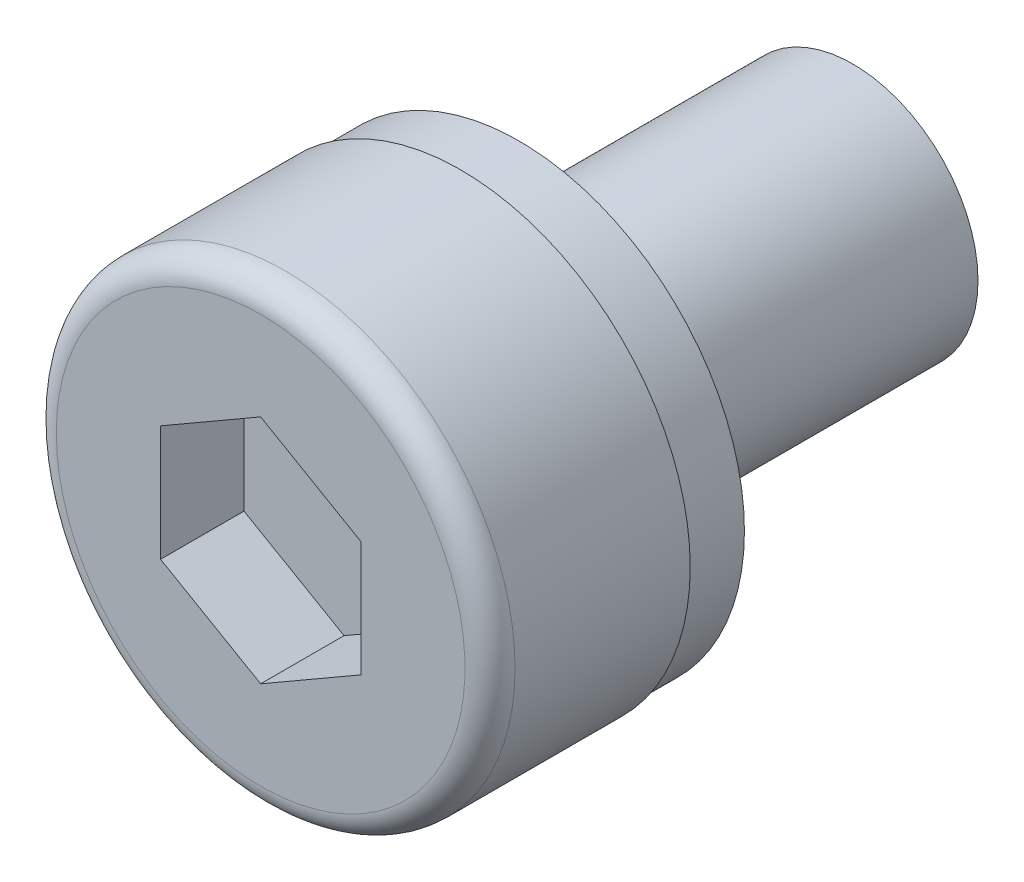
ISO-10303-21;
HEADER;
FILE_DESCRIPTION(('STEP AP214'),'2;1');
FILE_NAME('part.step','',(''),(''),'','','');
FILE_SCHEMA(('AUTOMOTIVE_DESIGN { 1 0 10303 214 1 1 1 1 }'));
ENDSEC;
DATA;
#1=APPLICATION_CONTEXT('core data for automotive mechanical design processes');
#2=APPLICATION_PROTOCOL_DEFINITION('international standard','automotive_design',2000,#1);
#3=PRODUCT_CONTEXT('',#1,'mechanical');
#4=PRODUCT('Part','Part','',(#3));
#5=PRODUCT_RELATED_PRODUCT_CATEGORY('part','',(#4));
#6=PRODUCT_DEFINITION_FORMATION('','',#4);
#7=PRODUCT_DEFINITION_CONTEXT('part definition',#1,'design');
#8=PRODUCT_DEFINITION('design','',#6,#7);
#9=PRODUCT_DEFINITION_SHAPE('','',#8);
#10=(LENGTH_UNIT() NAMED_UNIT(*) SI_UNIT(.MILLI.,.METRE.));
#11=(NAMED_UNIT(*) PLANE_ANGLE_UNIT() SI_UNIT($,.RADIAN.));
#12=(NAMED_UNIT(*) SI_UNIT($,.STERADIAN.) SOLID_ANGLE_UNIT());
#13=UNCERTAINTY_MEASURE_WITH_UNIT(LENGTH_MEASURE(1.E-05),#10,'distance_accuracy_value','');
#14=(GEOMETRIC_REPRESENTATION_CONTEXT(3) GLOBAL_UNCERTAINTY_ASSIGNED_CONTEXT((#13)) GLOBAL_UNIT_ASSIGNED_CONTEXT((#10,
#11,#12)) REPRESENTATION_CONTEXT('',''));
#15=CARTESIAN_POINT('',(0.,0.,0.));
#16=DIRECTION('',(0.,0.,1.));
#17=DIRECTION('',(1.,0.,0.));
#18=AXIS2_PLACEMENT_3D('',#15,#16,#17);
#19=CARTESIAN_POINT('',(0.,0.,0.));
#20=DIRECTION('',(0.,0.,-1.));
#21=DIRECTION('',(1.,0.,0.));
#22=AXIS2_PLACEMENT_3D('',#19,#20,#21);
#23=CYLINDRICAL_SURFACE('',#22,1.5);
#24=CARTESIAN_POINT('',(0.,0.,-4.));
#25=DIRECTION('',(0.,0.,1.));
#26=DIRECTION('',(1.,0.,0.));
#27=AXIS2_PLACEMENT_3D('',#24,#25,#26);
#28=CIRCLE('',#27,1.5);
#29=CARTESIAN_POINT('',(-1.5,0.,-4.));
#30=VERTEX_POINT('',#29);
#31=EDGE_CURVE('E130',#30,#30,#28,.T.);
#32=ORIENTED_EDGE('',*,*,#31,.T.);
#33=DIRECTION('',(0.,0.,1.));
#34=VECTOR('',#33,1.);
#35=CARTESIAN_POINT('',(-1.5,0.,0.));
#36=LINE('',#35,#34);
#37=CARTESIAN_POINT('',(-1.5,0.,0.));
#38=VERTEX_POINT('',#37);
#39=EDGE_CURVE('E11',#30,#38,#36,.T.);
#40=ORIENTED_EDGE('',*,*,#39,.T.);
#41=CARTESIAN_POINT('',(0.,0.,0.));
#42=DIRECTION('',(0.,0.,1.));
#43=DIRECTION('',(1.,0.,0.));
#44=AXIS2_PLACEMENT_3D('',#41,#42,#43);
#45=CIRCLE('',#44,1.5);
#46=EDGE_CURVE('E27',#38,#38,#45,.T.);
#47=ORIENTED_EDGE('',*,*,#46,.F.);
#48=ORIENTED_EDGE('',*,*,#39,.F.);
#49=EDGE_LOOP('',(#32,#40,#47,#48));
#50=FACE_BOUND('',#49,.T.);
#51=ADVANCED_FACE('F17',(#50),#23,.T.);
#52=CARTESIAN_POINT('',(0.,0.,0.));
#53=DIRECTION('',(0.,0.,1.));
#54=DIRECTION('',(1.,0.,0.));
#55=AXIS2_PLACEMENT_3D('',#52,#53,#54);
#56=PLANE('',#55);
#57=ORIENTED_EDGE('',*,*,#46,.T.);
#58=EDGE_LOOP('',(#57));
#59=FACE_BOUND('',#58,.T.);
#60=CARTESIAN_POINT('',(0.,0.,0.));
#61=DIRECTION('',(0.,0.,-1.));
#62=DIRECTION('',(1.,0.,0.));
#63=AXIS2_PLACEMENT_3D('',#60,#61,#62);
#64=CIRCLE('',#63,2.6999999396503);
#65=CARTESIAN_POINT('',(-2.6999999396503,0.,0.));
#66=VERTEX_POINT('',#65);
#67=EDGE_CURVE('E148',#66,#66,#64,.T.);
#68=ORIENTED_EDGE('',*,*,#67,.T.);
#69=EDGE_LOOP('',(#68));
#70=FACE_BOUND('',#69,.T.);
#71=ADVANCED_FACE('F242',(#59,#70),#56,.F.);
#72=CARTESIAN_POINT('',(0.,0.,2.1));
#73=DIRECTION('',(0.,0.,-1.));
#74=DIRECTION('',(0.,-1.,0.));
#75=AXIS2_PLACEMENT_3D('',#72,#73,#74);
#76=PLANE('',#75);
#77=DIRECTION('',(0.,-1.,0.));
#78=VECTOR('',#77,1.);
#79=CARTESIAN_POINT('',(1.19999997317791,-0.692820307541811,2.1));
#80=LINE('',#79,#78);
#81=CARTESIAN_POINT('',(1.19999997317791,0.69282030754181,2.1));
#82=VERTEX_POINT('',#81);
#83=CARTESIAN_POINT('',(1.19999997317791,-0.692820307541811,2.1));
#84=VERTEX_POINT('',#83);
#85=EDGE_CURVE('E51',#82,#84,#80,.T.);
#86=ORIENTED_EDGE('',*,*,#85,.F.);
#87=DIRECTION('',(0.866025403784439,-0.5,0.));
#88=VECTOR('',#87,1.);
#89=CARTESIAN_POINT('',(1.19999997317791,0.69282030754181,2.1));
#90=LINE('',#89,#88);
#91=CARTESIAN_POINT('',(0.,1.38564061508362,2.1));
#92=VERTEX_POINT('',#91);
#93=EDGE_CURVE('E21',#92,#82,#90,.T.);
#94=ORIENTED_EDGE('',*,*,#93,.F.);
#95=DIRECTION('',(0.866025403784439,0.5,0.));
#96=VECTOR('',#95,1.);
#97=CARTESIAN_POINT('',(0.,1.38564061508362,2.1));
#98=LINE('',#97,#96);
#99=CARTESIAN_POINT('',(-1.19999997317791,0.69282030754181,2.1));
#100=VERTEX_POINT('',#99);
#101=EDGE_CURVE('E144',#100,#92,#98,.T.);
#102=ORIENTED_EDGE('',*,*,#101,.F.);
#103=DIRECTION('',(0.,1.,0.));
#104=VECTOR('',#103,1.);
#105=CARTESIAN_POINT('',(-1.19999997317791,0.69282030754181,2.1));
#106=LINE('',#105,#104);
#107=CARTESIAN_POINT('',(-1.19999997317791,-0.692820307541809,2.1));
#108=VERTEX_POINT('',#107);
#109=EDGE_CURVE('E180',#108,#100,#106,.T.);
#110=ORIENTED_EDGE('',*,*,#109,.F.);
#111=DIRECTION('',(-0.866025403784439,0.5,0.));
#112=VECTOR('',#111,1.);
#113=CARTESIAN_POINT('',(-1.19999997317791,-0.692820307541809,2.1));
#114=LINE('',#113,#112);
#115=CARTESIAN_POINT('',(0.,-1.38564061508362,2.1));
#116=VERTEX_POINT('',#115);
#117=EDGE_CURVE('E179',#116,#108,#114,.T.);
#118=ORIENTED_EDGE('',*,*,#117,.F.);
#119=DIRECTION('',(-0.866025403784439,-0.5,0.));
#120=VECTOR('',#119,1.);
#121=CARTESIAN_POINT('',(0.,-1.38564061508362,2.1));
#122=LINE('',#121,#120);
#123=EDGE_CURVE('E138',#84,#116,#122,.T.);
#124=ORIENTED_EDGE('',*,*,#123,.F.);
#125=EDGE_LOOP('',(#86,#94,#102,#110,#118,#124));
#126=FACE_BOUND('',#125,.T.);
#127=ADVANCED_FACE('F442',(#126),#76,.F.);
#128=CARTESIAN_POINT('',(1.19999997317791,0.69282030754181,3.1));
#129=DIRECTION('',(1.,0.,0.));
#130=DIRECTION('',(0.,-1.,0.));
#131=AXIS2_PLACEMENT_3D('',#128,#129,#130);
#132=PLANE('',#131);
#133=DIRECTION('',(0.,-1.,0.));
#134=VECTOR('',#133,1.);
#135=CARTESIAN_POINT('',(1.19999997317791,0.346410153770905,3.1));
#136=LINE('',#135,#134);
#137=CARTESIAN_POINT('',(1.19999997317791,0.69282030754181,3.1));
#138=VERTEX_POINT('',#137);
#139=CARTESIAN_POINT('',(1.19999997317791,-0.692820307541811,3.1));
#140=VERTEX_POINT('',#139);
#141=EDGE_CURVE('E166',#138,#140,#136,.T.);
#142=ORIENTED_EDGE('',*,*,#141,.F.);
#143=DIRECTION('',(0.,0.,-1.));
#144=VECTOR('',#143,1.);
#145=CARTESIAN_POINT('',(1.19999997317791,0.69282030754181,3.1));
#146=LINE('',#145,#144);
#147=EDGE_CURVE('E187',#138,#82,#146,.T.);
#148=ORIENTED_EDGE('',*,*,#147,.T.);
#149=ORIENTED_EDGE('',*,*,#85,.T.);
#150=DIRECTION('',(0.,0.,-1.));
#151=VECTOR('',#150,1.);
#152=CARTESIAN_POINT('',(1.19999997317791,-0.692820307541811,3.1));
#153=LINE('',#152,#151);
#154=EDGE_CURVE('E192',#140,#84,#153,.T.);
#155=ORIENTED_EDGE('',*,*,#154,.F.);
#156=EDGE_LOOP('',(#142,#148,#149,#155));
#157=FACE_BOUND('',#156,.T.);
#158=ADVANCED_FACE('F432',(#157),#132,.F.);
#159=CARTESIAN_POINT('',(1.19999997317791,-0.692820307541811,3.1));
#160=DIRECTION('',(0.5,-0.866025403784439,0.));
#161=DIRECTION('',(0.,0.,-1.));
#162=AXIS2_PLACEMENT_3D('',#159,#160,#161);
#163=PLANE('',#162);
#164=DIRECTION('',(-0.866025403784439,-0.5,0.));
#165=VECTOR('',#164,1.);
#166=CARTESIAN_POINT('',(0.899999979883432,-0.866025384427263,3.1));
#167=LINE('',#166,#165);
#168=CARTESIAN_POINT('',(0.,-1.38564061508362,3.1));
#169=VERTEX_POINT('',#168);
#170=EDGE_CURVE('E161',#140,#169,#167,.T.);
#171=ORIENTED_EDGE('',*,*,#170,.F.);
#172=ORIENTED_EDGE('',*,*,#154,.T.);
#173=ORIENTED_EDGE('',*,*,#123,.T.);
#174=DIRECTION('',(0.,0.,-1.));
#175=VECTOR('',#174,1.);
#176=CARTESIAN_POINT('',(0.,-1.38564061508362,3.1));
#177=LINE('',#176,#175);
#178=EDGE_CURVE('E175',#169,#116,#177,.T.);
#179=ORIENTED_EDGE('',*,*,#178,.F.);
#180=EDGE_LOOP('',(#171,#172,#173,#179));
#181=FACE_BOUND('',#180,.T.);
#182=ADVANCED_FACE('F422',(#181),#163,.F.);
#183=CARTESIAN_POINT('',(0.,-1.38564061508362,3.1));
#184=DIRECTION('',(-0.5,-0.866025403784438,0.));
#185=DIRECTION('',(-0.866025403784438,0.5,0.));
#186=AXIS2_PLACEMENT_3D('',#183,#184,#185);
#187=PLANE('',#186);
#188=DIRECTION('',(-0.866025403784439,0.5,0.));
#189=VECTOR('',#188,1.);
#190=CARTESIAN_POINT('',(-0.299999993294478,-1.21243553819817,3.1));
#191=LINE('',#190,#189);
#192=CARTESIAN_POINT('',(-1.19999997317791,-0.692820307541809,3.1));
#193=VERTEX_POINT('',#192);
#194=EDGE_CURVE('E165',#169,#193,#191,.T.);
#195=ORIENTED_EDGE('',*,*,#194,.F.);
#196=ORIENTED_EDGE('',*,*,#178,.T.);
#197=ORIENTED_EDGE('',*,*,#117,.T.);
#198=DIRECTION('',(0.,0.,-1.));
#199=VECTOR('',#198,1.);
#200=CARTESIAN_POINT('',(-1.19999997317791,-0.692820307541809,3.1));
#201=LINE('',#200,#199);
#202=EDGE_CURVE('E116',#193,#108,#201,.T.);
#203=ORIENTED_EDGE('',*,*,#202,.F.);
#204=EDGE_LOOP('',(#195,#196,#197,#203));
#205=FACE_BOUND('',#204,.T.);
#206=ADVANCED_FACE('F414',(#205),#187,.F.);
#207=CARTESIAN_POINT('',(-1.19999997317791,-0.692820307541809,3.1));
#208=DIRECTION('',(-1.,0.,0.));
#209=DIRECTION('',(0.,0.,1.));
#210=AXIS2_PLACEMENT_3D('',#207,#208,#209);
#211=PLANE('',#210);
#212=DIRECTION('',(0.,1.,0.));
#213=VECTOR('',#212,1.);
#214=CARTESIAN_POINT('',(-1.19999997317791,-0.346410153770904,3.1));
#215=LINE('',#214,#213);
#216=CARTESIAN_POINT('',(-1.19999997317791,0.69282030754181,3.1));
#217=VERTEX_POINT('',#216);
#218=EDGE_CURVE('E155',#193,#217,#215,.T.);
#219=ORIENTED_EDGE('',*,*,#218,.F.);
#220=ORIENTED_EDGE('',*,*,#202,.T.);
#221=ORIENTED_EDGE('',*,*,#109,.T.);
#222=DIRECTION('',(0.,0.,-1.));
#223=VECTOR('',#222,1.);
#224=CARTESIAN_POINT('',(-1.19999997317791,0.69282030754181,3.1));
#225=LINE('',#224,#223);
#226=EDGE_CURVE('E126',#217,#100,#225,.T.);
#227=ORIENTED_EDGE('',*,*,#226,.F.);
#228=EDGE_LOOP('',(#219,#220,#221,#227));
#229=FACE_BOUND('',#228,.T.);
#230=ADVANCED_FACE('F406',(#229),#211,.F.);
#231=CARTESIAN_POINT('',(-1.19999997317791,0.69282030754181,3.1));
#232=DIRECTION('',(-0.5,0.866025403784439,0.));
#233=DIRECTION('',(0.,0.,1.));
#234=AXIS2_PLACEMENT_3D('',#231,#232,#233);
#235=PLANE('',#234);
#236=DIRECTION('',(0.866025403784439,0.5,0.));
#237=VECTOR('',#236,1.);
#238=CARTESIAN_POINT('',(-0.899999979883432,0.866025384427263,3.1));
#239=LINE('',#238,#237);
#240=CARTESIAN_POINT('',(0.,1.38564061508362,3.1));
#241=VERTEX_POINT('',#240);
#242=EDGE_CURVE('E150',#217,#241,#239,.T.);
#243=ORIENTED_EDGE('',*,*,#242,.F.);
#244=ORIENTED_EDGE('',*,*,#226,.T.);
#245=ORIENTED_EDGE('',*,*,#101,.T.);
#246=DIRECTION('',(0.,0.,-1.));
#247=VECTOR('',#246,1.);
#248=CARTESIAN_POINT('',(0.,1.38564061508362,3.1));
#249=LINE('',#248,#247);
#250=EDGE_CURVE('E154',#241,#92,#249,.T.);
#251=ORIENTED_EDGE('',*,*,#250,.F.);
#252=EDGE_LOOP('',(#243,#244,#245,#251));
#253=FACE_BOUND('',#252,.T.);
#254=ADVANCED_FACE('F19',(#253),#235,.F.);
#255=CARTESIAN_POINT('',(0.,1.38564061508362,3.1));
#256=DIRECTION('',(0.5,0.866025403784439,0.));
#257=DIRECTION('',(0.,0.,-1.));
#258=AXIS2_PLACEMENT_3D('',#255,#256,#257);
#259=PLANE('',#258);
#260=DIRECTION('',(0.866025403784439,-0.5,0.));
#261=VECTOR('',#260,1.);
#262=CARTESIAN_POINT('',(0.299999993294478,1.21243553819817,3.1));
#263=LINE('',#262,#261);
#264=EDGE_CURVE('E158',#241,#138,#263,.T.);
#265=ORIENTED_EDGE('',*,*,#264,.F.);
#266=ORIENTED_EDGE('',*,*,#250,.T.);
#267=ORIENTED_EDGE('',*,*,#93,.T.);
#268=ORIENTED_EDGE('',*,*,#147,.F.);
#269=EDGE_LOOP('',(#265,#266,#267,#268));
#270=FACE_BOUND('',#269,.T.);
#271=ADVANCED_FACE('F390',(#270),#259,.F.);
#272=CARTESIAN_POINT('',(0.,0.,3.1));
#273=DIRECTION('',(0.,0.,1.));
#274=DIRECTION('',(1.,0.,0.));
#275=AXIS2_PLACEMENT_3D('',#272,#273,#274);
#276=PLANE('',#275);
#277=ORIENTED_EDGE('',*,*,#264,.T.);
#278=ORIENTED_EDGE('',*,*,#141,.T.);
#279=ORIENTED_EDGE('',*,*,#170,.T.);
#280=ORIENTED_EDGE('',*,*,#194,.T.);
#281=ORIENTED_EDGE('',*,*,#218,.T.);
#282=ORIENTED_EDGE('',*,*,#242,.T.);
#283=EDGE_LOOP('',(#277,#278,#279,#280,#281,#282));
#284=FACE_BOUND('',#283,.T.);
#285=CARTESIAN_POINT('',(0.,0.,3.1));
#286=DIRECTION('',(0.,0.,-1.));
#287=DIRECTION('',(-1.,0.,0.));
#288=AXIS2_PLACEMENT_3D('',#285,#286,#287);
#289=CIRCLE('',#288,2.45);
#290=CARTESIAN_POINT('',(-2.45,0.,3.1));
#291=VERTEX_POINT('',#290);
#292=EDGE_CURVE('E196',#291,#291,#289,.T.);
#293=ORIENTED_EDGE('',*,*,#292,.F.);
#294=EDGE_LOOP('',(#293));
#295=FACE_BOUND('',#294,.T.);
#296=ADVANCED_FACE('F381',(#284,#295),#276,.T.);
#297=CARTESIAN_POINT('',(0.,0.,0.));
#298=DIRECTION('',(0.,0.,1.));
#299=DIRECTION('',(-1.,0.,0.));
#300=AXIS2_PLACEMENT_3D('',#297,#298,#299);
#301=CYLINDRICAL_SURFACE('',#300,2.75);
#302=CARTESIAN_POINT('',(0.,0.,2.8));
#303=DIRECTION('',(0.,0.,1.));
#304=DIRECTION('',(-1.,0.,0.));
#305=AXIS2_PLACEMENT_3D('',#302,#303,#304);
#306=CIRCLE('',#305,2.75);
#307=CARTESIAN_POINT('',(2.75,0.,2.8));
#308=VERTEX_POINT('',#307);
#309=CARTESIAN_POINT('',(-2.75,0.,2.8));
#310=VERTEX_POINT('',#309);
#311=EDGE_CURVE('E159',#308,#310,#306,.T.);
#312=ORIENTED_EDGE('',*,*,#311,.F.);
#313=DIRECTION('',(0.,0.,-1.));
#314=VECTOR('',#313,1.);
#315=CARTESIAN_POINT('',(2.75,0.,0.));
#316=LINE('',#315,#314);
#317=CARTESIAN_POINT('',(2.75,0.,0.7));
#318=VERTEX_POINT('',#317);
#319=EDGE_CURVE('E156',#308,#318,#316,.T.);
#320=ORIENTED_EDGE('',*,*,#319,.T.);
#321=CARTESIAN_POINT('',(0.,0.,0.7));
#322=DIRECTION('',(0.,0.,1.));
#323=DIRECTION('',(-1.,0.,0.));
#324=AXIS2_PLACEMENT_3D('',#321,#322,#323);
#325=CIRCLE('',#324,2.75);
#326=EDGE_CURVE('E200',#318,#318,#325,.T.);
#327=ORIENTED_EDGE('',*,*,#326,.T.);
#328=ORIENTED_EDGE('',*,*,#319,.F.);
#329=CARTESIAN_POINT('',(0.,0.,2.8));
#330=DIRECTION('',(0.,0.,1.));
#331=DIRECTION('',(-1.,0.,0.));
#332=AXIS2_PLACEMENT_3D('',#329,#330,#331);
#333=CIRCLE('',#332,2.75);
#334=EDGE_CURVE('E181',#310,#308,#333,.T.);
#335=ORIENTED_EDGE('',*,*,#334,.F.);
#336=EDGE_LOOP('',(#312,#320,#327,#328,#335));
#337=FACE_BOUND('',#336,.T.);
#338=ADVANCED_FACE('F255',(#337),#301,.T.);
#339=CARTESIAN_POINT('',(0.,0.,2.8));
#340=DIRECTION('',(0.,0.,1.));
#341=DIRECTION('',(1.,0.,0.));
#342=AXIS2_PLACEMENT_3D('',#339,#340,#341);
#343=TOROIDAL_SURFACE('',#342,2.45,0.3);
#344=ORIENTED_EDGE('',*,*,#292,.T.);
#345=CARTESIAN_POINT('',(-2.45,0.,2.8));
#346=DIRECTION('',(0.,-1.,0.));
#347=DIRECTION('',(-1.,0.,0.));
#348=AXIS2_PLACEMENT_3D('',#345,#346,#347);
#349=CIRCLE('',#348,0.3);
#350=EDGE_CURVE('E142',#291,#310,#349,.T.);
#351=ORIENTED_EDGE('',*,*,#350,.T.);
#352=ORIENTED_EDGE('',*,*,#334,.T.);
#353=ORIENTED_EDGE('',*,*,#311,.T.);
#354=ORIENTED_EDGE('',*,*,#350,.F.);
#355=EDGE_LOOP('',(#344,#351,#352,#353,#354));
#356=FACE_BOUND('',#355,.T.);
#357=ADVANCED_FACE('F250',(#356),#343,.T.);
#358=CARTESIAN_POINT('',(0.,0.,0.7));
#359=DIRECTION('',(0.,0.,-1.));
#360=DIRECTION('',(0.,-1.,0.));
#361=AXIS2_PLACEMENT_3D('',#358,#359,#360);
#362=PLANE('',#361);
#363=CARTESIAN_POINT('',(0.,0.,0.7));
#364=DIRECTION('',(0.,0.,-1.));
#365=DIRECTION('',(1.,0.,0.));
#366=AXIS2_PLACEMENT_3D('',#363,#364,#365);
#367=CIRCLE('',#366,2.6999999396503);
#368=CARTESIAN_POINT('',(-2.6999999396503,0.,0.7));
#369=VERTEX_POINT('',#368);
#370=EDGE_CURVE('E174',#369,#369,#367,.T.);
#371=ORIENTED_EDGE('',*,*,#370,.F.);
#372=EDGE_LOOP('',(#371));
#373=FACE_BOUND('',#372,.T.);
#374=ORIENTED_EDGE('',*,*,#326,.F.);
#375=EDGE_LOOP('',(#374));
#376=FACE_BOUND('',#375,.T.);
#377=ADVANCED_FACE('F247',(#373,#376),#362,.T.);
#378=CARTESIAN_POINT('',(0.,0.,0.));
#379=DIRECTION('',(0.,0.,1.));
#380=DIRECTION('',(1.,0.,0.));
#381=AXIS2_PLACEMENT_3D('',#378,#379,#380);
#382=CYLINDRICAL_SURFACE('',#381,2.6999999396503);
#383=ORIENTED_EDGE('',*,*,#67,.F.);
#384=DIRECTION('',(0.,0.,1.));
#385=VECTOR('',#384,1.);
#386=CARTESIAN_POINT('',(-2.6999999396503,0.,0.));
#387=LINE('',#386,#385);
#388=EDGE_CURVE('E170',#66,#369,#387,.T.);
#389=ORIENTED_EDGE('',*,*,#388,.T.);
#390=ORIENTED_EDGE('',*,*,#370,.T.);
#391=ORIENTED_EDGE('',*,*,#388,.F.);
#392=EDGE_LOOP('',(#383,#389,#390,#391));
#393=FACE_BOUND('',#392,.T.);
#394=ADVANCED_FACE('F244',(#393),#382,.T.);
#395=CARTESIAN_POINT('',(0.,0.,-4.));
#396=DIRECTION('',(0.,0.,-1.));
#397=DIRECTION('',(0.,-1.,0.));
#398=AXIS2_PLACEMENT_3D('',#395,#396,#397);
#399=PLANE('',#398);
#400=ORIENTED_EDGE('',*,*,#31,.F.);
#401=EDGE_LOOP('',(#400));
#402=FACE_BOUND('',#401,.T.);
#403=ADVANCED_FACE('F339',(#402),#399,.T.);
#404=CLOSED_SHELL('',(#51,#71,#127,#158,#182,#206,#230,#254,#271,#296,#338,#357,#377,#394,#403));
#405=MANIFOLD_SOLID_BREP('B1',#404);
#406=ADVANCED_BREP_SHAPE_REPRESENTATION('',(#18,#405),#14);
#407=SHAPE_DEFINITION_REPRESENTATION(#9,#406);
ENDSEC;
END-ISO-10303-21;
